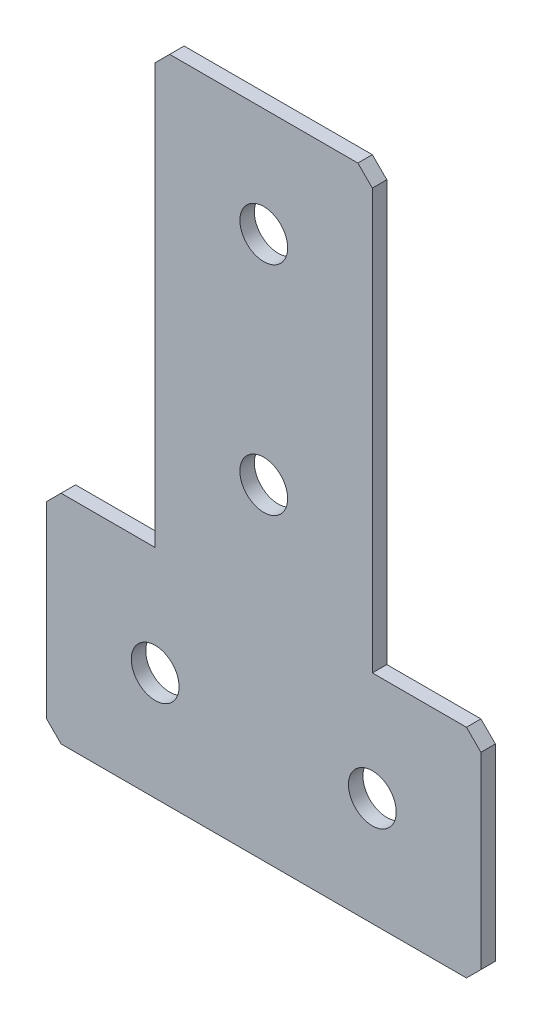
ISO-10303-21;
HEADER;
FILE_DESCRIPTION(('STEP AP214'),'2;1');
FILE_NAME('part.step','',(''),(''),'','','');
FILE_SCHEMA(('AUTOMOTIVE_DESIGN { 1 0 10303 214 1 1 1 1 }'));
ENDSEC;
DATA;
#1=APPLICATION_CONTEXT('core data for automotive mechanical design processes');
#2=APPLICATION_PROTOCOL_DEFINITION('international standard','automotive_design',2000,#1);
#3=PRODUCT_CONTEXT('',#1,'mechanical');
#4=PRODUCT('Part','Part','',(#3));
#5=PRODUCT_RELATED_PRODUCT_CATEGORY('part','',(#4));
#6=PRODUCT_DEFINITION_FORMATION('','',#4);
#7=PRODUCT_DEFINITION_CONTEXT('part definition',#1,'design');
#8=PRODUCT_DEFINITION('design','',#6,#7);
#9=PRODUCT_DEFINITION_SHAPE('','',#8);
#10=(LENGTH_UNIT() NAMED_UNIT(*) SI_UNIT(.MILLI.,.METRE.));
#11=(NAMED_UNIT(*) PLANE_ANGLE_UNIT() SI_UNIT($,.RADIAN.));
#12=(NAMED_UNIT(*) SI_UNIT($,.STERADIAN.) SOLID_ANGLE_UNIT());
#13=UNCERTAINTY_MEASURE_WITH_UNIT(LENGTH_MEASURE(1.E-05),#10,'distance_accuracy_value','');
#14=(GEOMETRIC_REPRESENTATION_CONTEXT(3) GLOBAL_UNCERTAINTY_ASSIGNED_CONTEXT((#13)) GLOBAL_UNIT_ASSIGNED_CONTEXT((#10,
#11,#12)) REPRESENTATION_CONTEXT('',''));
#15=CARTESIAN_POINT('',(0.,0.,0.));
#16=DIRECTION('',(0.,0.,1.));
#17=DIRECTION('',(1.,0.,0.));
#18=AXIS2_PLACEMENT_3D('',#15,#16,#17);
#19=CARTESIAN_POINT('',(-15.,-60.,-2.));
#20=DIRECTION('',(1.,0.,0.));
#21=DIRECTION('',(0.,1.,0.));
#22=AXIS2_PLACEMENT_3D('',#19,#20,#21);
#23=PLANE('',#22);
#24=DIRECTION('',(0.,1.,0.));
#25=VECTOR('',#24,1.);
#26=CARTESIAN_POINT('',(-15.,-60.,0.));
#27=LINE('',#26,#25);
#28=CARTESIAN_POINT('',(-15.,-60.,0.));
#29=VERTEX_POINT('',#28);
#30=CARTESIAN_POINT('',(-15.,-2.,0.));
#31=VERTEX_POINT('',#30);
#32=EDGE_CURVE('E178',#29,#31,#27,.T.);
#33=ORIENTED_EDGE('',*,*,#32,.T.);
#34=DIRECTION('',(0.,0.,-1.));
#35=VECTOR('',#34,1.);
#36=CARTESIAN_POINT('',(-15.,-2.,-2.));
#37=LINE('',#36,#35);
#38=CARTESIAN_POINT('',(-15.,-2.,-2.));
#39=VERTEX_POINT('',#38);
#40=EDGE_CURVE('E240',#31,#39,#37,.T.);
#41=ORIENTED_EDGE('',*,*,#40,.T.);
#42=DIRECTION('',(0.,1.,0.));
#43=VECTOR('',#42,1.);
#44=CARTESIAN_POINT('',(-15.,-60.,-2.));
#45=LINE('',#44,#43);
#46=CARTESIAN_POINT('',(-15.,-60.,-2.));
#47=VERTEX_POINT('',#46);
#48=EDGE_CURVE('E198',#47,#39,#45,.T.);
#49=ORIENTED_EDGE('',*,*,#48,.F.);
#50=DIRECTION('',(0.,0.,1.));
#51=VECTOR('',#50,1.);
#52=CARTESIAN_POINT('',(-15.,-60.,-2.));
#53=LINE('',#52,#51);
#54=EDGE_CURVE('E163',#47,#29,#53,.T.);
#55=ORIENTED_EDGE('',*,*,#54,.T.);
#56=EDGE_LOOP('',(#33,#41,#49,#55));
#57=FACE_BOUND('',#56,.T.);
#58=ADVANCED_FACE('F37',(#57),#23,.F.);
#59=CARTESIAN_POINT('',(15.,0.,-2.));
#60=DIRECTION('',(0.,-1.,0.));
#61=DIRECTION('',(1.,0.,0.));
#62=AXIS2_PLACEMENT_3D('',#59,#60,#61);
#63=PLANE('',#62);
#64=DIRECTION('',(1.,0.,0.));
#65=VECTOR('',#64,1.);
#66=CARTESIAN_POINT('',(15.,0.,-2.));
#67=LINE('',#66,#65);
#68=CARTESIAN_POINT('',(-13.,0.,-2.));
#69=VERTEX_POINT('',#68);
#70=CARTESIAN_POINT('',(13.,0.,-2.));
#71=VERTEX_POINT('',#70);
#72=EDGE_CURVE('E152',#69,#71,#67,.T.);
#73=ORIENTED_EDGE('',*,*,#72,.F.);
#74=DIRECTION('',(0.,0.,1.));
#75=VECTOR('',#74,1.);
#76=CARTESIAN_POINT('',(-13.,0.,-2.));
#77=LINE('',#76,#75);
#78=CARTESIAN_POINT('',(-13.,0.,0.));
#79=VERTEX_POINT('',#78);
#80=EDGE_CURVE('E237',#69,#79,#77,.T.);
#81=ORIENTED_EDGE('',*,*,#80,.T.);
#82=DIRECTION('',(1.,0.,0.));
#83=VECTOR('',#82,1.);
#84=CARTESIAN_POINT('',(15.,0.,0.));
#85=LINE('',#84,#83);
#86=CARTESIAN_POINT('',(13.,0.,0.));
#87=VERTEX_POINT('',#86);
#88=EDGE_CURVE('E181',#79,#87,#85,.T.);
#89=ORIENTED_EDGE('',*,*,#88,.T.);
#90=DIRECTION('',(0.,0.,-1.));
#91=VECTOR('',#90,1.);
#92=CARTESIAN_POINT('',(13.,0.,-2.));
#93=LINE('',#92,#91);
#94=EDGE_CURVE('E235',#87,#71,#93,.T.);
#95=ORIENTED_EDGE('',*,*,#94,.T.);
#96=EDGE_LOOP('',(#73,#81,#89,#95));
#97=FACE_BOUND('',#96,.T.);
#98=ADVANCED_FACE('F288',(#97),#63,.F.);
#99=CARTESIAN_POINT('',(15.,-60.,-2.));
#100=DIRECTION('',(-1.,0.,0.));
#101=DIRECTION('',(0.,-1.,0.));
#102=AXIS2_PLACEMENT_3D('',#99,#100,#101);
#103=PLANE('',#102);
#104=DIRECTION('',(0.,-1.,0.));
#105=VECTOR('',#104,1.);
#106=CARTESIAN_POINT('',(15.,-60.,-2.));
#107=LINE('',#106,#105);
#108=CARTESIAN_POINT('',(15.,-1.99999999999999,-2.));
#109=VERTEX_POINT('',#108);
#110=CARTESIAN_POINT('',(15.,-60.,-2.));
#111=VERTEX_POINT('',#110);
#112=EDGE_CURVE('E139',#109,#111,#107,.T.);
#113=ORIENTED_EDGE('',*,*,#112,.F.);
#114=DIRECTION('',(0.,0.,1.));
#115=VECTOR('',#114,1.);
#116=CARTESIAN_POINT('',(15.,-1.99999999999999,-2.));
#117=LINE('',#116,#115);
#118=CARTESIAN_POINT('',(15.,-1.99999999999999,0.));
#119=VERTEX_POINT('',#118);
#120=EDGE_CURVE('E242',#109,#119,#117,.T.);
#121=ORIENTED_EDGE('',*,*,#120,.T.);
#122=DIRECTION('',(0.,-1.,0.));
#123=VECTOR('',#122,1.);
#124=CARTESIAN_POINT('',(15.,-60.,0.));
#125=LINE('',#124,#123);
#126=CARTESIAN_POINT('',(15.,-60.,0.));
#127=VERTEX_POINT('',#126);
#128=EDGE_CURVE('E158',#119,#127,#125,.T.);
#129=ORIENTED_EDGE('',*,*,#128,.T.);
#130=DIRECTION('',(0.,0.,1.));
#131=VECTOR('',#130,1.);
#132=CARTESIAN_POINT('',(15.,-60.,-2.));
#133=LINE('',#132,#131);
#134=EDGE_CURVE('E155',#111,#127,#133,.T.);
#135=ORIENTED_EDGE('',*,*,#134,.F.);
#136=EDGE_LOOP('',(#113,#121,#129,#135));
#137=FACE_BOUND('',#136,.T.);
#138=ADVANCED_FACE('F156',(#137),#103,.F.);
#139=CARTESIAN_POINT('',(30.,-60.,-2.));
#140=DIRECTION('',(0.,-1.,0.));
#141=DIRECTION('',(0.,0.,-1.));
#142=AXIS2_PLACEMENT_3D('',#139,#140,#141);
#143=PLANE('',#142);
#144=DIRECTION('',(1.,0.,0.));
#145=VECTOR('',#144,1.);
#146=CARTESIAN_POINT('',(30.,-60.,0.));
#147=LINE('',#146,#145);
#148=CARTESIAN_POINT('',(28.,-60.,0.));
#149=VERTEX_POINT('',#148);
#150=EDGE_CURVE('E186',#127,#149,#147,.T.);
#151=ORIENTED_EDGE('',*,*,#150,.T.);
#152=DIRECTION('',(0.,0.,-1.));
#153=VECTOR('',#152,1.);
#154=CARTESIAN_POINT('',(28.,-60.,-2.));
#155=LINE('',#154,#153);
#156=CARTESIAN_POINT('',(28.,-60.,-2.));
#157=VERTEX_POINT('',#156);
#158=EDGE_CURVE('E11',#149,#157,#155,.T.);
#159=ORIENTED_EDGE('',*,*,#158,.T.);
#160=DIRECTION('',(1.,0.,0.));
#161=VECTOR('',#160,1.);
#162=CARTESIAN_POINT('',(30.,-60.,-2.));
#163=LINE('',#162,#161);
#164=EDGE_CURVE('E144',#111,#157,#163,.T.);
#165=ORIENTED_EDGE('',*,*,#164,.F.);
#166=ORIENTED_EDGE('',*,*,#134,.T.);
#167=EDGE_LOOP('',(#151,#159,#165,#166));
#168=FACE_BOUND('',#167,.T.);
#169=ADVANCED_FACE('F165',(#168),#143,.F.);
#170=CARTESIAN_POINT('',(30.,-90.,-2.));
#171=DIRECTION('',(-1.,0.,0.));
#172=DIRECTION('',(0.,0.,1.));
#173=AXIS2_PLACEMENT_3D('',#170,#171,#172);
#174=PLANE('',#173);
#175=DIRECTION('',(0.,-1.,0.));
#176=VECTOR('',#175,1.);
#177=CARTESIAN_POINT('',(30.,-90.,-2.));
#178=LINE('',#177,#176);
#179=CARTESIAN_POINT('',(30.,-62.,-2.));
#180=VERTEX_POINT('',#179);
#181=CARTESIAN_POINT('',(30.,-88.,-2.));
#182=VERTEX_POINT('',#181);
#183=EDGE_CURVE('E167',#180,#182,#178,.T.);
#184=ORIENTED_EDGE('',*,*,#183,.F.);
#185=DIRECTION('',(0.,0.,1.));
#186=VECTOR('',#185,1.);
#187=CARTESIAN_POINT('',(30.,-62.,-2.));
#188=LINE('',#187,#186);
#189=CARTESIAN_POINT('',(30.,-62.,0.));
#190=VERTEX_POINT('',#189);
#191=EDGE_CURVE('E45',#180,#190,#188,.T.);
#192=ORIENTED_EDGE('',*,*,#191,.T.);
#193=DIRECTION('',(0.,-1.,0.));
#194=VECTOR('',#193,1.);
#195=CARTESIAN_POINT('',(30.,-90.,0.));
#196=LINE('',#195,#194);
#197=CARTESIAN_POINT('',(30.,-88.,0.));
#198=VERTEX_POINT('',#197);
#199=EDGE_CURVE('E188',#190,#198,#196,.T.);
#200=ORIENTED_EDGE('',*,*,#199,.T.);
#201=DIRECTION('',(0.,0.,-1.));
#202=VECTOR('',#201,1.);
#203=CARTESIAN_POINT('',(30.,-88.,-2.));
#204=LINE('',#203,#202);
#205=EDGE_CURVE('E60',#198,#182,#204,.T.);
#206=ORIENTED_EDGE('',*,*,#205,.T.);
#207=EDGE_LOOP('',(#184,#192,#200,#206));
#208=FACE_BOUND('',#207,.T.);
#209=ADVANCED_FACE('F247',(#208),#174,.F.);
#210=CARTESIAN_POINT('',(-30.,-90.,-2.));
#211=DIRECTION('',(0.,1.,0.));
#212=DIRECTION('',(0.,0.,1.));
#213=AXIS2_PLACEMENT_3D('',#210,#211,#212);
#214=PLANE('',#213);
#215=DIRECTION('',(-1.,0.,0.));
#216=VECTOR('',#215,1.);
#217=CARTESIAN_POINT('',(-30.,-90.,0.));
#218=LINE('',#217,#216);
#219=CARTESIAN_POINT('',(28.,-90.,0.));
#220=VERTEX_POINT('',#219);
#221=CARTESIAN_POINT('',(-28.,-90.,0.));
#222=VERTEX_POINT('',#221);
#223=EDGE_CURVE('E190',#220,#222,#218,.T.);
#224=ORIENTED_EDGE('',*,*,#223,.T.);
#225=DIRECTION('',(0.,0.,-1.));
#226=VECTOR('',#225,1.);
#227=CARTESIAN_POINT('',(-28.,-90.,-2.));
#228=LINE('',#227,#226);
#229=CARTESIAN_POINT('',(-28.,-90.,-2.));
#230=VERTEX_POINT('',#229);
#231=EDGE_CURVE('E220',#222,#230,#228,.T.);
#232=ORIENTED_EDGE('',*,*,#231,.T.);
#233=DIRECTION('',(-1.,0.,0.));
#234=VECTOR('',#233,1.);
#235=CARTESIAN_POINT('',(-30.,-90.,-2.));
#236=LINE('',#235,#234);
#237=CARTESIAN_POINT('',(28.,-90.,-2.));
#238=VERTEX_POINT('',#237);
#239=EDGE_CURVE('E169',#238,#230,#236,.T.);
#240=ORIENTED_EDGE('',*,*,#239,.F.);
#241=DIRECTION('',(0.,0.,1.));
#242=VECTOR('',#241,1.);
#243=CARTESIAN_POINT('',(28.,-90.,-2.));
#244=LINE('',#243,#242);
#245=EDGE_CURVE('E217',#238,#220,#244,.T.);
#246=ORIENTED_EDGE('',*,*,#245,.T.);
#247=EDGE_LOOP('',(#224,#232,#240,#246));
#248=FACE_BOUND('',#247,.T.);
#249=ADVANCED_FACE('F258',(#248),#214,.F.);
#250=CARTESIAN_POINT('',(-30.,-90.,-2.));
#251=DIRECTION('',(1.,0.,0.));
#252=DIRECTION('',(0.,0.,-1.));
#253=AXIS2_PLACEMENT_3D('',#250,#251,#252);
#254=PLANE('',#253);
#255=DIRECTION('',(0.,1.,0.));
#256=VECTOR('',#255,1.);
#257=CARTESIAN_POINT('',(-30.,-90.,-2.));
#258=LINE('',#257,#256);
#259=CARTESIAN_POINT('',(-30.,-88.,-2.));
#260=VERTEX_POINT('',#259);
#261=CARTESIAN_POINT('',(-30.,-62.,-2.));
#262=VERTEX_POINT('',#261);
#263=EDGE_CURVE('E174',#260,#262,#258,.T.);
#264=ORIENTED_EDGE('',*,*,#263,.F.);
#265=DIRECTION('',(0.,0.,1.));
#266=VECTOR('',#265,1.);
#267=CARTESIAN_POINT('',(-30.,-88.,-2.));
#268=LINE('',#267,#266);
#269=CARTESIAN_POINT('',(-30.,-88.,0.));
#270=VERTEX_POINT('',#269);
#271=EDGE_CURVE('E202',#260,#270,#268,.T.);
#272=ORIENTED_EDGE('',*,*,#271,.T.);
#273=DIRECTION('',(0.,1.,0.));
#274=VECTOR('',#273,1.);
#275=CARTESIAN_POINT('',(-30.,-90.,0.));
#276=LINE('',#275,#274);
#277=CARTESIAN_POINT('',(-30.,-62.,0.));
#278=VERTEX_POINT('',#277);
#279=EDGE_CURVE('E193',#270,#278,#276,.T.);
#280=ORIENTED_EDGE('',*,*,#279,.T.);
#281=DIRECTION('',(0.,0.,-1.));
#282=VECTOR('',#281,1.);
#283=CARTESIAN_POINT('',(-30.,-62.,-2.));
#284=LINE('',#283,#282);
#285=EDGE_CURVE('E162',#278,#262,#284,.T.);
#286=ORIENTED_EDGE('',*,*,#285,.T.);
#287=EDGE_LOOP('',(#264,#272,#280,#286));
#288=FACE_BOUND('',#287,.T.);
#289=ADVANCED_FACE('F266',(#288),#254,.F.);
#290=CARTESIAN_POINT('',(-30.,-60.,-2.));
#291=DIRECTION('',(0.,-1.,0.));
#292=DIRECTION('',(0.,0.,-1.));
#293=AXIS2_PLACEMENT_3D('',#290,#291,#292);
#294=PLANE('',#293);
#295=DIRECTION('',(1.,0.,0.));
#296=VECTOR('',#295,1.);
#297=CARTESIAN_POINT('',(-30.,-60.,-2.));
#298=LINE('',#297,#296);
#299=CARTESIAN_POINT('',(-28.,-60.,-2.));
#300=VERTEX_POINT('',#299);
#301=EDGE_CURVE('E176',#300,#47,#298,.T.);
#302=ORIENTED_EDGE('',*,*,#301,.F.);
#303=DIRECTION('',(0.,0.,1.));
#304=VECTOR('',#303,1.);
#305=CARTESIAN_POINT('',(-28.,-60.,-2.));
#306=LINE('',#305,#304);
#307=CARTESIAN_POINT('',(-28.,-60.,0.));
#308=VERTEX_POINT('',#307);
#309=EDGE_CURVE('E232',#300,#308,#306,.T.);
#310=ORIENTED_EDGE('',*,*,#309,.T.);
#311=DIRECTION('',(1.,0.,0.));
#312=VECTOR('',#311,1.);
#313=CARTESIAN_POINT('',(-30.,-60.,0.));
#314=LINE('',#313,#312);
#315=EDGE_CURVE('E196',#308,#29,#314,.T.);
#316=ORIENTED_EDGE('',*,*,#315,.T.);
#317=ORIENTED_EDGE('',*,*,#54,.F.);
#318=EDGE_LOOP('',(#302,#310,#316,#317));
#319=FACE_BOUND('',#318,.T.);
#320=ADVANCED_FACE('F274',(#319),#294,.F.);
#321=CARTESIAN_POINT('',(0.,0.,-2.));
#322=DIRECTION('',(0.,0.,1.));
#323=DIRECTION('',(1.,0.,0.));
#324=AXIS2_PLACEMENT_3D('',#321,#322,#323);
#325=PLANE('',#324);
#326=CARTESIAN_POINT('',(-15.,-75.,-2.));
#327=DIRECTION('',(0.,0.,-1.));
#328=DIRECTION('',(0.,1.,0.));
#329=AXIS2_PLACEMENT_3D('',#326,#327,#328);
#330=CIRCLE('',#329,3.3);
#331=CARTESIAN_POINT('',(-15.,-71.7,-2.));
#332=VERTEX_POINT('',#331);
#333=EDGE_CURVE('E313',#332,#332,#330,.T.);
#334=ORIENTED_EDGE('',*,*,#333,.F.);
#335=EDGE_LOOP('',(#334));
#336=FACE_BOUND('',#335,.T.);
#337=CARTESIAN_POINT('',(15.,-75.,-2.));
#338=DIRECTION('',(0.,0.,-1.));
#339=DIRECTION('',(0.,1.,0.));
#340=AXIS2_PLACEMENT_3D('',#337,#338,#339);
#341=CIRCLE('',#340,3.3);
#342=CARTESIAN_POINT('',(15.,-71.7,-2.));
#343=VERTEX_POINT('',#342);
#344=EDGE_CURVE('E307',#343,#343,#341,.T.);
#345=ORIENTED_EDGE('',*,*,#344,.F.);
#346=EDGE_LOOP('',(#345));
#347=FACE_BOUND('',#346,.T.);
#348=CARTESIAN_POINT('',(0.,-45.,-2.));
#349=DIRECTION('',(0.,0.,-1.));
#350=DIRECTION('',(0.,1.,0.));
#351=AXIS2_PLACEMENT_3D('',#348,#349,#350);
#352=CIRCLE('',#351,3.3);
#353=CARTESIAN_POINT('',(0.,-41.7,-2.));
#354=VERTEX_POINT('',#353);
#355=EDGE_CURVE('E301',#354,#354,#352,.T.);
#356=ORIENTED_EDGE('',*,*,#355,.F.);
#357=EDGE_LOOP('',(#356));
#358=FACE_BOUND('',#357,.T.);
#359=CARTESIAN_POINT('',(0.,-15.,-2.));
#360=DIRECTION('',(0.,0.,-1.));
#361=DIRECTION('',(0.,1.,0.));
#362=AXIS2_PLACEMENT_3D('',#359,#360,#361);
#363=CIRCLE('',#362,3.3);
#364=CARTESIAN_POINT('',(0.,-11.7,-2.));
#365=VERTEX_POINT('',#364);
#366=EDGE_CURVE('E295',#365,#365,#363,.T.);
#367=ORIENTED_EDGE('',*,*,#366,.F.);
#368=EDGE_LOOP('',(#367));
#369=FACE_BOUND('',#368,.T.);
#370=ORIENTED_EDGE('',*,*,#239,.T.);
#371=DIRECTION('',(0.707106781186552,-0.707106781186543,0.));
#372=VECTOR('',#371,1.);
#373=CARTESIAN_POINT('',(-30.,-88.,-2.));
#374=LINE('',#373,#372);
#375=EDGE_CURVE('E230',#230,#260,#374,.F.);
#376=ORIENTED_EDGE('',*,*,#375,.T.);
#377=ORIENTED_EDGE('',*,*,#263,.T.);
#378=DIRECTION('',(-0.707106781186545,-0.70710678118655,0.));
#379=VECTOR('',#378,1.);
#380=CARTESIAN_POINT('',(-28.,-60.,-2.));
#381=LINE('',#380,#379);
#382=EDGE_CURVE('E52',#262,#300,#381,.F.);
#383=ORIENTED_EDGE('',*,*,#382,.T.);
#384=ORIENTED_EDGE('',*,*,#301,.T.);
#385=ORIENTED_EDGE('',*,*,#48,.T.);
#386=DIRECTION('',(-0.707106781186545,-0.70710678118655,0.));
#387=VECTOR('',#386,1.);
#388=CARTESIAN_POINT('',(-13.,0.,-2.));
#389=LINE('',#388,#387);
#390=EDGE_CURVE('E227',#39,#69,#389,.F.);
#391=ORIENTED_EDGE('',*,*,#390,.T.);
#392=ORIENTED_EDGE('',*,*,#72,.T.);
#393=DIRECTION('',(-0.70710678118655,0.707106781186545,0.));
#394=VECTOR('',#393,1.);
#395=CARTESIAN_POINT('',(15.,-1.99999999999999,-2.));
#396=LINE('',#395,#394);
#397=EDGE_CURVE('E148',#71,#109,#396,.F.);
#398=ORIENTED_EDGE('',*,*,#397,.T.);
#399=ORIENTED_EDGE('',*,*,#112,.T.);
#400=ORIENTED_EDGE('',*,*,#164,.T.);
#401=DIRECTION('',(-0.70710678118655,0.707106781186545,0.));
#402=VECTOR('',#401,1.);
#403=CARTESIAN_POINT('',(30.,-62.,-2.));
#404=LINE('',#403,#402);
#405=EDGE_CURVE('E224',#157,#180,#404,.F.);
#406=ORIENTED_EDGE('',*,*,#405,.T.);
#407=ORIENTED_EDGE('',*,*,#183,.T.);
#408=DIRECTION('',(0.707106781186545,0.70710678118655,0.));
#409=VECTOR('',#408,1.);
#410=CARTESIAN_POINT('',(28.,-90.,-2.));
#411=LINE('',#410,#409);
#412=EDGE_CURVE('E222',#182,#238,#411,.F.);
#413=ORIENTED_EDGE('',*,*,#412,.T.);
#414=EDGE_LOOP('',(#370,#376,#377,#383,#384,#385,#391,#392,#398,#399,#400,#406,#407,#413));
#415=FACE_BOUND('',#414,.T.);
#416=ADVANCED_FACE('F142',(#336,#347,#358,#369,#415),#325,.F.);
#417=CARTESIAN_POINT('',(0.,0.,0.));
#418=DIRECTION('',(0.,0.,1.));
#419=DIRECTION('',(1.,0.,0.));
#420=AXIS2_PLACEMENT_3D('',#417,#418,#419);
#421=PLANE('',#420);
#422=CARTESIAN_POINT('',(-15.,-75.,0.));
#423=DIRECTION('',(0.,0.,-1.));
#424=DIRECTION('',(0.,1.,0.));
#425=AXIS2_PLACEMENT_3D('',#422,#423,#424);
#426=CIRCLE('',#425,3.3);
#427=CARTESIAN_POINT('',(-15.,-71.7,0.));
#428=VERTEX_POINT('',#427);
#429=EDGE_CURVE('E310',#428,#428,#426,.T.);
#430=ORIENTED_EDGE('',*,*,#429,.T.);
#431=EDGE_LOOP('',(#430));
#432=FACE_BOUND('',#431,.T.);
#433=CARTESIAN_POINT('',(15.,-75.,0.));
#434=DIRECTION('',(0.,0.,-1.));
#435=DIRECTION('',(0.,1.,0.));
#436=AXIS2_PLACEMENT_3D('',#433,#434,#435);
#437=CIRCLE('',#436,3.3);
#438=CARTESIAN_POINT('',(15.,-71.7,0.));
#439=VERTEX_POINT('',#438);
#440=EDGE_CURVE('E304',#439,#439,#437,.T.);
#441=ORIENTED_EDGE('',*,*,#440,.T.);
#442=EDGE_LOOP('',(#441));
#443=FACE_BOUND('',#442,.T.);
#444=CARTESIAN_POINT('',(0.,-45.,0.));
#445=DIRECTION('',(0.,0.,-1.));
#446=DIRECTION('',(0.,1.,0.));
#447=AXIS2_PLACEMENT_3D('',#444,#445,#446);
#448=CIRCLE('',#447,3.3);
#449=CARTESIAN_POINT('',(0.,-41.7,0.));
#450=VERTEX_POINT('',#449);
#451=EDGE_CURVE('E298',#450,#450,#448,.T.);
#452=ORIENTED_EDGE('',*,*,#451,.T.);
#453=EDGE_LOOP('',(#452));
#454=FACE_BOUND('',#453,.T.);
#455=CARTESIAN_POINT('',(0.,-15.,0.));
#456=DIRECTION('',(0.,0.,-1.));
#457=DIRECTION('',(0.,1.,0.));
#458=AXIS2_PLACEMENT_3D('',#455,#456,#457);
#459=CIRCLE('',#458,3.3);
#460=CARTESIAN_POINT('',(0.,-11.7,0.));
#461=VERTEX_POINT('',#460);
#462=EDGE_CURVE('E182',#461,#461,#459,.T.);
#463=ORIENTED_EDGE('',*,*,#462,.T.);
#464=EDGE_LOOP('',(#463));
#465=FACE_BOUND('',#464,.T.);
#466=ORIENTED_EDGE('',*,*,#279,.F.);
#467=DIRECTION('',(-0.707106781186552,0.707106781186543,0.));
#468=VECTOR('',#467,1.);
#469=CARTESIAN_POINT('',(-58.9999999999998,-59.0000000000006,0.));
#470=LINE('',#469,#468);
#471=EDGE_CURVE('E215',#270,#222,#470,.F.);
#472=ORIENTED_EDGE('',*,*,#471,.T.);
#473=ORIENTED_EDGE('',*,*,#223,.F.);
#474=DIRECTION('',(-0.707106781186545,-0.70710678118655,0.));
#475=VECTOR('',#474,1.);
#476=CARTESIAN_POINT('',(59.0000000000001,-58.9999999999997,0.));
#477=LINE('',#476,#475);
#478=EDGE_CURVE('E205',#220,#198,#477,.F.);
#479=ORIENTED_EDGE('',*,*,#478,.T.);
#480=ORIENTED_EDGE('',*,*,#199,.F.);
#481=DIRECTION('',(0.70710678118655,-0.707106781186545,0.));
#482=VECTOR('',#481,1.);
#483=CARTESIAN_POINT('',(-16.0000000000001,-16.0000000000002,0.));
#484=LINE('',#483,#482);
#485=EDGE_CURVE('E207',#190,#149,#484,.F.);
#486=ORIENTED_EDGE('',*,*,#485,.T.);
#487=ORIENTED_EDGE('',*,*,#150,.F.);
#488=ORIENTED_EDGE('',*,*,#128,.F.);
#489=DIRECTION('',(0.70710678118655,-0.707106781186545,0.));
#490=VECTOR('',#489,1.);
#491=CARTESIAN_POINT('',(6.49999999999996,6.5,0.));
#492=LINE('',#491,#490);
#493=EDGE_CURVE('E209',#119,#87,#492,.F.);
#494=ORIENTED_EDGE('',*,*,#493,.T.);
#495=ORIENTED_EDGE('',*,*,#88,.F.);
#496=DIRECTION('',(0.707106781186545,0.70710678118655,0.));
#497=VECTOR('',#496,1.);
#498=CARTESIAN_POINT('',(-6.50000000000006,6.50000000000001,0.));
#499=LINE('',#498,#497);
#500=EDGE_CURVE('E211',#79,#31,#499,.F.);
#501=ORIENTED_EDGE('',*,*,#500,.T.);
#502=ORIENTED_EDGE('',*,*,#32,.F.);
#503=ORIENTED_EDGE('',*,*,#315,.F.);
#504=DIRECTION('',(0.707106781186545,0.70710678118655,0.));
#505=VECTOR('',#504,1.);
#506=CARTESIAN_POINT('',(15.9999999999999,-15.9999999999998,0.));
#507=LINE('',#506,#505);
#508=EDGE_CURVE('E213',#308,#278,#507,.F.);
#509=ORIENTED_EDGE('',*,*,#508,.T.);
#510=EDGE_LOOP('',(#466,#472,#473,#479,#480,#486,#487,#488,#494,#495,#501,#502,#503,#509));
#511=FACE_BOUND('',#510,.T.);
#512=ADVANCED_FACE('F251',(#432,#443,#454,#465,#511),#421,.T.);
#513=CARTESIAN_POINT('',(0.,-15.,-2.));
#514=DIRECTION('',(0.,0.,-1.));
#515=DIRECTION('',(0.,1.,0.));
#516=AXIS2_PLACEMENT_3D('',#513,#514,#515);
#517=CYLINDRICAL_SURFACE('',#516,3.3);
#518=ORIENTED_EDGE('',*,*,#462,.F.);
#519=EDGE_LOOP('',(#518));
#520=FACE_BOUND('',#519,.T.);
#521=ORIENTED_EDGE('',*,*,#366,.T.);
#522=EDGE_LOOP('',(#521));
#523=FACE_BOUND('',#522,.T.);
#524=ADVANCED_FACE('F328',(#520,#523),#517,.F.);
#525=CARTESIAN_POINT('',(0.,-45.,-2.));
#526=DIRECTION('',(0.,0.,-1.));
#527=DIRECTION('',(0.,1.,0.));
#528=AXIS2_PLACEMENT_3D('',#525,#526,#527);
#529=CYLINDRICAL_SURFACE('',#528,3.3);
#530=ORIENTED_EDGE('',*,*,#451,.F.);
#531=EDGE_LOOP('',(#530));
#532=FACE_BOUND('',#531,.T.);
#533=ORIENTED_EDGE('',*,*,#355,.T.);
#534=EDGE_LOOP('',(#533));
#535=FACE_BOUND('',#534,.T.);
#536=ADVANCED_FACE('F330',(#532,#535),#529,.F.);
#537=CARTESIAN_POINT('',(15.,-75.,-2.));
#538=DIRECTION('',(0.,0.,-1.));
#539=DIRECTION('',(0.,1.,0.));
#540=AXIS2_PLACEMENT_3D('',#537,#538,#539);
#541=CYLINDRICAL_SURFACE('',#540,3.3);
#542=ORIENTED_EDGE('',*,*,#440,.F.);
#543=EDGE_LOOP('',(#542));
#544=FACE_BOUND('',#543,.T.);
#545=ORIENTED_EDGE('',*,*,#344,.T.);
#546=EDGE_LOOP('',(#545));
#547=FACE_BOUND('',#546,.T.);
#548=ADVANCED_FACE('F337',(#544,#547),#541,.F.);
#549=CARTESIAN_POINT('',(-15.,-75.,-2.));
#550=DIRECTION('',(0.,0.,-1.));
#551=DIRECTION('',(0.,1.,0.));
#552=AXIS2_PLACEMENT_3D('',#549,#550,#551);
#553=CYLINDRICAL_SURFACE('',#552,3.3);
#554=ORIENTED_EDGE('',*,*,#429,.F.);
#555=EDGE_LOOP('',(#554));
#556=FACE_BOUND('',#555,.T.);
#557=ORIENTED_EDGE('',*,*,#333,.T.);
#558=EDGE_LOOP('',(#557));
#559=FACE_BOUND('',#558,.T.);
#560=ADVANCED_FACE('F317',(#556,#559),#553,.F.);
#561=CARTESIAN_POINT('',(-30.,-88.,-2.));
#562=DIRECTION('',(0.707106781186543,0.707106781186552,0.));
#563=DIRECTION('',(0.,0.,1.));
#564=AXIS2_PLACEMENT_3D('',#561,#562,#563);
#565=PLANE('',#564);
#566=ORIENTED_EDGE('',*,*,#375,.F.);
#567=ORIENTED_EDGE('',*,*,#231,.F.);
#568=ORIENTED_EDGE('',*,*,#471,.F.);
#569=ORIENTED_EDGE('',*,*,#271,.F.);
#570=EDGE_LOOP('',(#566,#567,#568,#569));
#571=FACE_BOUND('',#570,.T.);
#572=ADVANCED_FACE('F264',(#571),#565,.F.);
#573=CARTESIAN_POINT('',(-28.,-60.,-2.));
#574=DIRECTION('',(0.70710678118655,-0.707106781186545,0.));
#575=DIRECTION('',(0.,0.,1.));
#576=AXIS2_PLACEMENT_3D('',#573,#574,#575);
#577=PLANE('',#576);
#578=ORIENTED_EDGE('',*,*,#382,.F.);
#579=ORIENTED_EDGE('',*,*,#285,.F.);
#580=ORIENTED_EDGE('',*,*,#508,.F.);
#581=ORIENTED_EDGE('',*,*,#309,.F.);
#582=EDGE_LOOP('',(#578,#579,#580,#581));
#583=FACE_BOUND('',#582,.T.);
#584=ADVANCED_FACE('F272',(#583),#577,.F.);
#585=CARTESIAN_POINT('',(-13.,0.,-2.));
#586=DIRECTION('',(0.70710678118655,-0.707106781186545,0.));
#587=DIRECTION('',(0.,0.,1.));
#588=AXIS2_PLACEMENT_3D('',#585,#586,#587);
#589=PLANE('',#588);
#590=ORIENTED_EDGE('',*,*,#390,.F.);
#591=ORIENTED_EDGE('',*,*,#40,.F.);
#592=ORIENTED_EDGE('',*,*,#500,.F.);
#593=ORIENTED_EDGE('',*,*,#80,.F.);
#594=EDGE_LOOP('',(#590,#591,#592,#593));
#595=FACE_BOUND('',#594,.T.);
#596=ADVANCED_FACE('F285',(#595),#589,.F.);
#597=CARTESIAN_POINT('',(15.,-1.99999999999999,-2.));
#598=DIRECTION('',(-0.707106781186545,-0.70710678118655,0.));
#599=DIRECTION('',(0.,0.,1.));
#600=AXIS2_PLACEMENT_3D('',#597,#598,#599);
#601=PLANE('',#600);
#602=ORIENTED_EDGE('',*,*,#397,.F.);
#603=ORIENTED_EDGE('',*,*,#94,.F.);
#604=ORIENTED_EDGE('',*,*,#493,.F.);
#605=ORIENTED_EDGE('',*,*,#120,.F.);
#606=EDGE_LOOP('',(#602,#603,#604,#605));
#607=FACE_BOUND('',#606,.T.);
#608=ADVANCED_FACE('F291',(#607),#601,.F.);
#609=CARTESIAN_POINT('',(30.,-62.,-2.));
#610=DIRECTION('',(-0.707106781186545,-0.70710678118655,0.));
#611=DIRECTION('',(0.,0.,1.));
#612=AXIS2_PLACEMENT_3D('',#609,#610,#611);
#613=PLANE('',#612);
#614=ORIENTED_EDGE('',*,*,#405,.F.);
#615=ORIENTED_EDGE('',*,*,#158,.F.);
#616=ORIENTED_EDGE('',*,*,#485,.F.);
#617=ORIENTED_EDGE('',*,*,#191,.F.);
#618=EDGE_LOOP('',(#614,#615,#616,#617));
#619=FACE_BOUND('',#618,.T.);
#620=ADVANCED_FACE('F358',(#619),#613,.F.);
#621=CARTESIAN_POINT('',(28.,-90.,-2.));
#622=DIRECTION('',(-0.70710678118655,0.707106781186545,0.));
#623=DIRECTION('',(0.,0.,1.));
#624=AXIS2_PLACEMENT_3D('',#621,#622,#623);
#625=PLANE('',#624);
#626=ORIENTED_EDGE('',*,*,#412,.F.);
#627=ORIENTED_EDGE('',*,*,#205,.F.);
#628=ORIENTED_EDGE('',*,*,#478,.F.);
#629=ORIENTED_EDGE('',*,*,#245,.F.);
#630=EDGE_LOOP('',(#626,#627,#628,#629));
#631=FACE_BOUND('',#630,.T.);
#632=ADVANCED_FACE('F39',(#631),#625,.F.);
#633=CLOSED_SHELL('',(#58,#98,#138,#169,#209,#249,#289,#320,#416,#512,#524,#536,#548,#560,#572,
#584,#596,#608,#620,#632));
#634=MANIFOLD_SOLID_BREP('B2',#633);
#635=ADVANCED_BREP_SHAPE_REPRESENTATION('',(#18,#634),#14);
#636=SHAPE_DEFINITION_REPRESENTATION(#9,#635);
ENDSEC;
END-ISO-10303-21;
